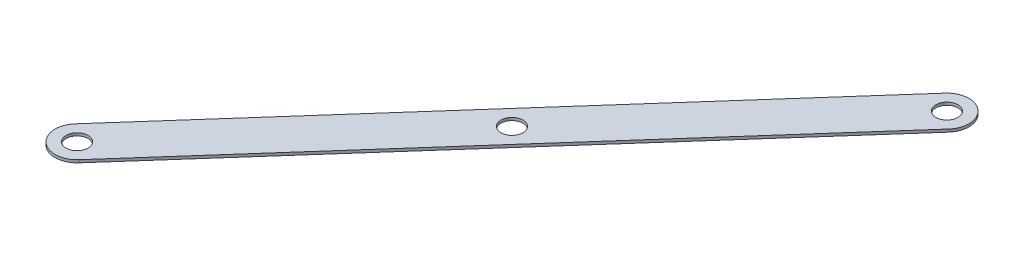
ISO-10303-21;
HEADER;
FILE_DESCRIPTION(('STEP AP214'),'2;1');
FILE_NAME('part.step','',(''),(''),'','','');
FILE_SCHEMA(('AUTOMOTIVE_DESIGN { 1 0 10303 214 1 1 1 1 }'));
ENDSEC;
DATA;
#1=APPLICATION_CONTEXT('core data for automotive mechanical design processes');
#2=APPLICATION_PROTOCOL_DEFINITION('international standard','automotive_design',2000,#1);
#3=PRODUCT_CONTEXT('',#1,'mechanical');
#4=PRODUCT('Part','Part','',(#3));
#5=PRODUCT_RELATED_PRODUCT_CATEGORY('part','',(#4));
#6=PRODUCT_DEFINITION_FORMATION('','',#4);
#7=PRODUCT_DEFINITION_CONTEXT('part definition',#1,'design');
#8=PRODUCT_DEFINITION('design','',#6,#7);
#9=PRODUCT_DEFINITION_SHAPE('','',#8);
#10=(LENGTH_UNIT() NAMED_UNIT(*) SI_UNIT(.MILLI.,.METRE.));
#11=(NAMED_UNIT(*) PLANE_ANGLE_UNIT() SI_UNIT($,.RADIAN.));
#12=(NAMED_UNIT(*) SI_UNIT($,.STERADIAN.) SOLID_ANGLE_UNIT());
#13=UNCERTAINTY_MEASURE_WITH_UNIT(LENGTH_MEASURE(1.E-05),#10,'distance_accuracy_value','');
#14=(GEOMETRIC_REPRESENTATION_CONTEXT(3) GLOBAL_UNCERTAINTY_ASSIGNED_CONTEXT((#13)) GLOBAL_UNIT_ASSIGNED_CONTEXT((#10,
#11,#12)) REPRESENTATION_CONTEXT('',''));
#15=CARTESIAN_POINT('',(0.,0.,0.));
#16=DIRECTION('',(0.,0.,1.));
#17=DIRECTION('',(1.,0.,0.));
#18=AXIS2_PLACEMENT_3D('',#15,#16,#17);
#19=CARTESIAN_POINT('',(0.,1.5875,0.));
#20=DIRECTION('',(0.,1.,0.));
#21=DIRECTION('',(0.,0.,1.));
#22=AXIS2_PLACEMENT_3D('',#19,#20,#21);
#23=PLANE('',#22);
#24=CARTESIAN_POINT('',(235.633683701559,1.5875,-266.323350657116));
#25=DIRECTION('',(0.,1.,0.));
#26=DIRECTION('',(0.,0.,1.));
#27=AXIS2_PLACEMENT_3D('',#24,#25,#26);
#28=CIRCLE('',#27,6.34999999999999);
#29=CARTESIAN_POINT('',(235.633683701559,1.5875,-259.973350657116));
#30=VERTEX_POINT('',#29);
#31=EDGE_CURVE('E119',#30,#30,#28,.T.);
#32=ORIENTED_EDGE('',*,*,#31,.F.);
#33=EDGE_LOOP('',(#32));
#34=FACE_BOUND('',#33,.T.);
#35=CARTESIAN_POINT('',(0.,1.5875,0.));
#36=DIRECTION('',(0.,1.,0.));
#37=DIRECTION('',(0.,0.,1.));
#38=AXIS2_PLACEMENT_3D('',#35,#36,#37);
#39=CIRCLE('',#38,12.7);
#40=CARTESIAN_POINT('',(-9.51154823775415,1.5875,-8.41548870362711));
#41=VERTEX_POINT('',#40);
#42=CARTESIAN_POINT('',(9.51154823775415,1.5875,8.41548870362712));
#43=VERTEX_POINT('',#42);
#44=EDGE_CURVE('E89',#41,#43,#39,.T.);
#45=ORIENTED_EDGE('',*,*,#44,.T.);
#46=DIRECTION('',(0.662636905797411,0.,-0.748940806122375));
#47=VECTOR('',#46,1.);
#48=CARTESIAN_POINT('',(9.51154823775415,1.5875,8.41548870362712));
#49=LINE('',#48,#47);
#50=CARTESIAN_POINT('',(245.145231939314,1.5875,-257.907861953489));
#51=VERTEX_POINT('',#50);
#52=EDGE_CURVE('E84',#43,#51,#49,.T.);
#53=ORIENTED_EDGE('',*,*,#52,.T.);
#54=CARTESIAN_POINT('',(235.633683701559,1.5875,-266.323350657116));
#55=DIRECTION('',(0.,1.,0.));
#56=DIRECTION('',(0.,0.,1.));
#57=AXIS2_PLACEMENT_3D('',#54,#55,#56);
#58=CIRCLE('',#57,12.7);
#59=CARTESIAN_POINT('',(226.122135463805,1.5875,-274.738839360744));
#60=VERTEX_POINT('',#59);
#61=EDGE_CURVE('E87',#51,#60,#58,.T.);
#62=ORIENTED_EDGE('',*,*,#61,.T.);
#63=DIRECTION('',(-0.662636905797411,0.,0.748940806122375));
#64=VECTOR('',#63,1.);
#65=CARTESIAN_POINT('',(-9.51154823775415,1.5875,-8.41548870362711));
#66=LINE('',#65,#64);
#67=EDGE_CURVE('E54',#60,#41,#66,.T.);
#68=ORIENTED_EDGE('',*,*,#67,.T.);
#69=EDGE_LOOP('',(#45,#53,#62,#68));
#70=FACE_BOUND('',#69,.T.);
#71=CARTESIAN_POINT('',(117.81684185078,1.5875,-133.161675328558));
#72=DIRECTION('',(0.,1.,0.));
#73=DIRECTION('',(0.,0.,1.));
#74=AXIS2_PLACEMENT_3D('',#71,#72,#73);
#75=CIRCLE('',#74,6.34999999999999);
#76=CARTESIAN_POINT('',(117.81684185078,1.5875,-126.811675328558));
#77=VERTEX_POINT('',#76);
#78=EDGE_CURVE('E104',#77,#77,#75,.T.);
#79=ORIENTED_EDGE('',*,*,#78,.F.);
#80=EDGE_LOOP('',(#79));
#81=FACE_BOUND('',#80,.T.);
#82=CARTESIAN_POINT('',(0.,1.5875,0.));
#83=DIRECTION('',(0.,1.,0.));
#84=DIRECTION('',(0.,0.,1.));
#85=AXIS2_PLACEMENT_3D('',#82,#83,#84);
#86=CIRCLE('',#85,6.35);
#87=CARTESIAN_POINT('',(0.,1.5875,6.35));
#88=VERTEX_POINT('',#87);
#89=EDGE_CURVE('E125',#88,#88,#86,.T.);
#90=ORIENTED_EDGE('',*,*,#89,.F.);
#91=EDGE_LOOP('',(#90));
#92=FACE_BOUND('',#91,.T.);
#93=ADVANCED_FACE('F37',(#34,#70,#81,#92),#23,.T.);
#94=CARTESIAN_POINT('',(0.,0.,0.));
#95=DIRECTION('',(0.,1.,0.));
#96=DIRECTION('',(0.,0.,1.));
#97=AXIS2_PLACEMENT_3D('',#94,#95,#96);
#98=PLANE('',#97);
#99=CARTESIAN_POINT('',(0.,0.,0.));
#100=DIRECTION('',(0.,1.,0.));
#101=DIRECTION('',(0.,0.,1.));
#102=AXIS2_PLACEMENT_3D('',#99,#100,#101);
#103=CIRCLE('',#102,12.7);
#104=CARTESIAN_POINT('',(-9.51154823775415,0.,-8.41548870362711));
#105=VERTEX_POINT('',#104);
#106=CARTESIAN_POINT('',(9.51154823775415,0.,8.41548870362712));
#107=VERTEX_POINT('',#106);
#108=EDGE_CURVE('E101',#105,#107,#103,.T.);
#109=ORIENTED_EDGE('',*,*,#108,.F.);
#110=DIRECTION('',(-0.662636905797411,0.,0.748940806122375));
#111=VECTOR('',#110,1.);
#112=CARTESIAN_POINT('',(-9.51154823775415,0.,-8.41548870362711));
#113=LINE('',#112,#111);
#114=CARTESIAN_POINT('',(226.122135463805,0.,-274.738839360744));
#115=VERTEX_POINT('',#114);
#116=EDGE_CURVE('E77',#115,#105,#113,.T.);
#117=ORIENTED_EDGE('',*,*,#116,.F.);
#118=CARTESIAN_POINT('',(235.633683701559,0.,-266.323350657116));
#119=DIRECTION('',(0.,1.,0.));
#120=DIRECTION('',(0.,0.,1.));
#121=AXIS2_PLACEMENT_3D('',#118,#119,#120);
#122=CIRCLE('',#121,12.7);
#123=CARTESIAN_POINT('',(245.145231939314,0.,-257.907861953489));
#124=VERTEX_POINT('',#123);
#125=EDGE_CURVE('E71',#124,#115,#122,.T.);
#126=ORIENTED_EDGE('',*,*,#125,.F.);
#127=DIRECTION('',(0.662636905797411,0.,-0.748940806122375));
#128=VECTOR('',#127,1.);
#129=CARTESIAN_POINT('',(9.51154823775415,0.,8.41548870362712));
#130=LINE('',#129,#128);
#131=EDGE_CURVE('E93',#107,#124,#130,.T.);
#132=ORIENTED_EDGE('',*,*,#131,.F.);
#133=EDGE_LOOP('',(#109,#117,#126,#132));
#134=FACE_BOUND('',#133,.T.);
#135=CARTESIAN_POINT('',(117.81684185078,0.,-133.161675328558));
#136=DIRECTION('',(0.,1.,0.));
#137=DIRECTION('',(0.,0.,1.));
#138=AXIS2_PLACEMENT_3D('',#135,#136,#137);
#139=CIRCLE('',#138,6.34999999999999);
#140=CARTESIAN_POINT('',(117.81684185078,0.,-126.811675328558));
#141=VERTEX_POINT('',#140);
#142=EDGE_CURVE('E116',#141,#141,#139,.T.);
#143=ORIENTED_EDGE('',*,*,#142,.T.);
#144=EDGE_LOOP('',(#143));
#145=FACE_BOUND('',#144,.T.);
#146=CARTESIAN_POINT('',(235.633683701559,0.,-266.323350657116));
#147=DIRECTION('',(0.,1.,0.));
#148=DIRECTION('',(0.,0.,1.));
#149=AXIS2_PLACEMENT_3D('',#146,#147,#148);
#150=CIRCLE('',#149,6.34999999999999);
#151=CARTESIAN_POINT('',(235.633683701559,0.,-259.973350657116));
#152=VERTEX_POINT('',#151);
#153=EDGE_CURVE('E122',#152,#152,#150,.T.);
#154=ORIENTED_EDGE('',*,*,#153,.T.);
#155=EDGE_LOOP('',(#154));
#156=FACE_BOUND('',#155,.T.);
#157=CARTESIAN_POINT('',(0.,0.,0.));
#158=DIRECTION('',(0.,1.,0.));
#159=DIRECTION('',(0.,0.,1.));
#160=AXIS2_PLACEMENT_3D('',#157,#158,#159);
#161=CIRCLE('',#160,6.35);
#162=CARTESIAN_POINT('',(0.,0.,6.35));
#163=VERTEX_POINT('',#162);
#164=EDGE_CURVE('E128',#163,#163,#161,.T.);
#165=ORIENTED_EDGE('',*,*,#164,.T.);
#166=EDGE_LOOP('',(#165));
#167=FACE_BOUND('',#166,.T.);
#168=ADVANCED_FACE('F112',(#134,#145,#156,#167),#98,.F.);
#169=CARTESIAN_POINT('',(0.,1.5875,0.));
#170=DIRECTION('',(0.,-1.,0.));
#171=DIRECTION('',(0.,0.,-1.));
#172=AXIS2_PLACEMENT_3D('',#169,#170,#171);
#173=CYLINDRICAL_SURFACE('',#172,12.7);
#174=ORIENTED_EDGE('',*,*,#108,.T.);
#175=DIRECTION('',(0.,-1.,0.));
#176=VECTOR('',#175,1.);
#177=CARTESIAN_POINT('',(9.51154823775415,1.5875,8.41548870362712));
#178=LINE('',#177,#176);
#179=EDGE_CURVE('E11',#43,#107,#178,.T.);
#180=ORIENTED_EDGE('',*,*,#179,.F.);
#181=ORIENTED_EDGE('',*,*,#44,.F.);
#182=DIRECTION('',(0.,-1.,0.));
#183=VECTOR('',#182,1.);
#184=CARTESIAN_POINT('',(-9.51154823775415,1.5875,-8.41548870362711));
#185=LINE('',#184,#183);
#186=EDGE_CURVE('E97',#41,#105,#185,.T.);
#187=ORIENTED_EDGE('',*,*,#186,.T.);
#188=EDGE_LOOP('',(#174,#180,#181,#187));
#189=FACE_BOUND('',#188,.T.);
#190=ADVANCED_FACE('F39',(#189),#173,.T.);
#191=CARTESIAN_POINT('',(9.51154823775415,1.5875,8.41548870362712));
#192=DIRECTION('',(-0.748940806122375,0.,-0.662636905797411));
#193=DIRECTION('',(-0.662636905797411,0.,0.748940806122375));
#194=AXIS2_PLACEMENT_3D('',#191,#192,#193);
#195=PLANE('',#194);
#196=ORIENTED_EDGE('',*,*,#131,.T.);
#197=DIRECTION('',(0.,-1.,0.));
#198=VECTOR('',#197,1.);
#199=CARTESIAN_POINT('',(245.145231939314,1.5875,-257.907861953489));
#200=LINE('',#199,#198);
#201=EDGE_CURVE('E46',#51,#124,#200,.T.);
#202=ORIENTED_EDGE('',*,*,#201,.F.);
#203=ORIENTED_EDGE('',*,*,#52,.F.);
#204=ORIENTED_EDGE('',*,*,#179,.T.);
#205=EDGE_LOOP('',(#196,#202,#203,#204));
#206=FACE_BOUND('',#205,.T.);
#207=ADVANCED_FACE('F92',(#206),#195,.F.);
#208=CARTESIAN_POINT('',(235.633683701559,1.5875,-266.323350657116));
#209=DIRECTION('',(0.,-1.,0.));
#210=DIRECTION('',(0.,0.,-1.));
#211=AXIS2_PLACEMENT_3D('',#208,#209,#210);
#212=CYLINDRICAL_SURFACE('',#211,12.7);
#213=ORIENTED_EDGE('',*,*,#125,.T.);
#214=DIRECTION('',(0.,-1.,0.));
#215=VECTOR('',#214,1.);
#216=CARTESIAN_POINT('',(226.122135463805,1.5875,-274.738839360744));
#217=LINE('',#216,#215);
#218=EDGE_CURVE('E94',#60,#115,#217,.T.);
#219=ORIENTED_EDGE('',*,*,#218,.F.);
#220=ORIENTED_EDGE('',*,*,#61,.F.);
#221=ORIENTED_EDGE('',*,*,#201,.T.);
#222=EDGE_LOOP('',(#213,#219,#220,#221));
#223=FACE_BOUND('',#222,.T.);
#224=ADVANCED_FACE('F95',(#223),#212,.T.);
#225=CARTESIAN_POINT('',(-9.51154823775415,1.5875,-8.41548870362711));
#226=DIRECTION('',(0.748940806122375,0.,0.662636905797411));
#227=DIRECTION('',(0.662636905797411,0.,-0.748940806122375));
#228=AXIS2_PLACEMENT_3D('',#225,#226,#227);
#229=PLANE('',#228);
#230=ORIENTED_EDGE('',*,*,#116,.T.);
#231=ORIENTED_EDGE('',*,*,#186,.F.);
#232=ORIENTED_EDGE('',*,*,#67,.F.);
#233=ORIENTED_EDGE('',*,*,#218,.T.);
#234=EDGE_LOOP('',(#230,#231,#232,#233));
#235=FACE_BOUND('',#234,.T.);
#236=ADVANCED_FACE('F109',(#235),#229,.F.);
#237=CARTESIAN_POINT('',(117.81684185078,1.5875,-133.161675328558));
#238=DIRECTION('',(0.,-1.,0.));
#239=DIRECTION('',(0.,0.,-1.));
#240=AXIS2_PLACEMENT_3D('',#237,#238,#239);
#241=CYLINDRICAL_SURFACE('',#240,6.34999999999999);
#242=ORIENTED_EDGE('',*,*,#78,.T.);
#243=EDGE_LOOP('',(#242));
#244=FACE_BOUND('',#243,.T.);
#245=ORIENTED_EDGE('',*,*,#142,.F.);
#246=EDGE_LOOP('',(#245));
#247=FACE_BOUND('',#246,.T.);
#248=ADVANCED_FACE('F146',(#244,#247),#241,.F.);
#249=CARTESIAN_POINT('',(235.633683701559,1.5875,-266.323350657116));
#250=DIRECTION('',(0.,-1.,0.));
#251=DIRECTION('',(0.,0.,-1.));
#252=AXIS2_PLACEMENT_3D('',#249,#250,#251);
#253=CYLINDRICAL_SURFACE('',#252,6.34999999999999);
#254=ORIENTED_EDGE('',*,*,#31,.T.);
#255=EDGE_LOOP('',(#254));
#256=FACE_BOUND('',#255,.T.);
#257=ORIENTED_EDGE('',*,*,#153,.F.);
#258=EDGE_LOOP('',(#257));
#259=FACE_BOUND('',#258,.T.);
#260=ADVANCED_FACE('F194',(#256,#259),#253,.F.);
#261=CARTESIAN_POINT('',(0.,1.5875,0.));
#262=DIRECTION('',(0.,-1.,0.));
#263=DIRECTION('',(0.,0.,-1.));
#264=AXIS2_PLACEMENT_3D('',#261,#262,#263);
#265=CYLINDRICAL_SURFACE('',#264,6.35);
#266=ORIENTED_EDGE('',*,*,#89,.T.);
#267=EDGE_LOOP('',(#266));
#268=FACE_BOUND('',#267,.T.);
#269=ORIENTED_EDGE('',*,*,#164,.F.);
#270=EDGE_LOOP('',(#269));
#271=FACE_BOUND('',#270,.T.);
#272=ADVANCED_FACE('F134',(#268,#271),#265,.F.);
#273=CLOSED_SHELL('',(#93,#168,#190,#207,#224,#236,#248,#260,#272));
#274=MANIFOLD_SOLID_BREP('B2',#273);
#275=ADVANCED_BREP_SHAPE_REPRESENTATION('',(#18,#274),#14);
#276=SHAPE_DEFINITION_REPRESENTATION(#9,#275);
ENDSEC;
END-ISO-10303-21;
